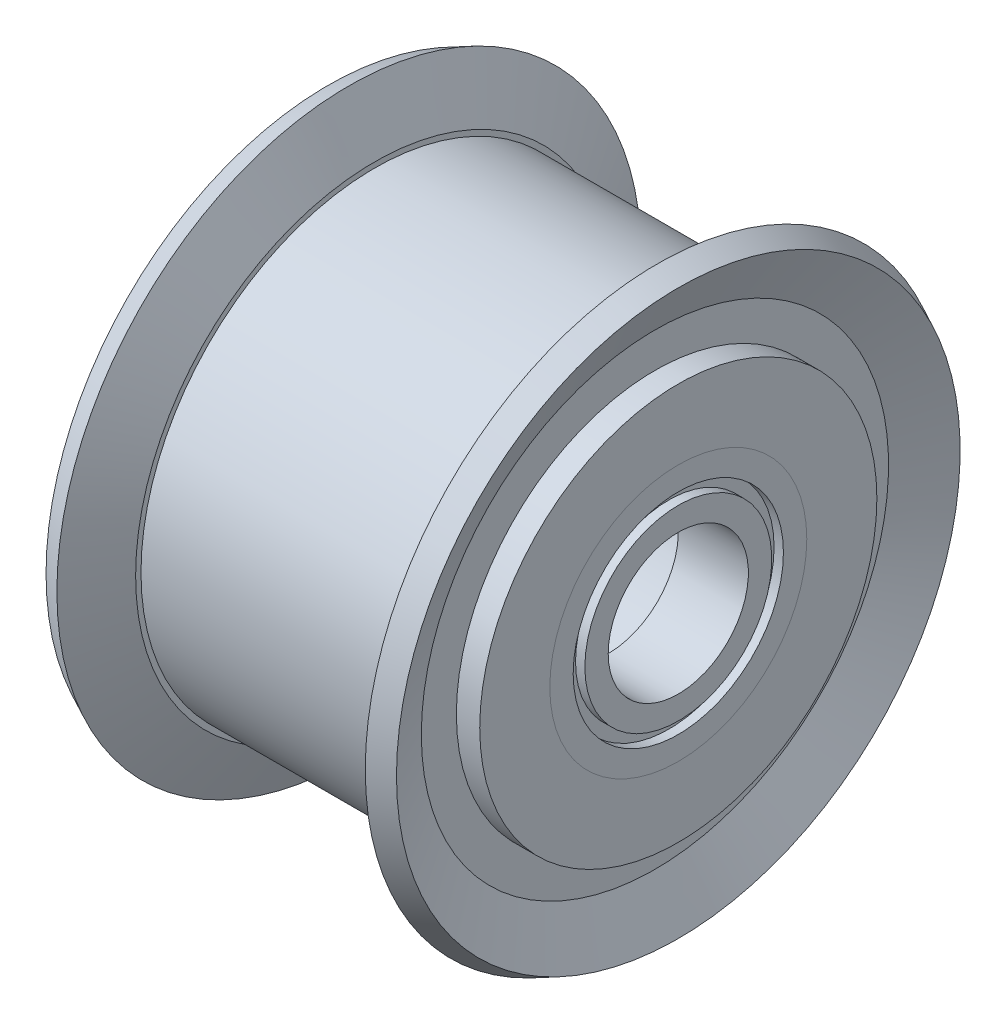
ISO-10303-21;
HEADER;
FILE_DESCRIPTION(('STEP AP214'),'2;1');
FILE_NAME('part.step','',(''),(''),'','','');
FILE_SCHEMA(('AUTOMOTIVE_DESIGN { 1 0 10303 214 1 1 1 1 }'));
ENDSEC;
DATA;
#1=APPLICATION_CONTEXT('core data for automotive mechanical design processes');
#2=APPLICATION_PROTOCOL_DEFINITION('international standard','automotive_design',2000,#1);
#3=PRODUCT_CONTEXT('',#1,'mechanical');
#4=PRODUCT('Part','Part','',(#3));
#5=PRODUCT_RELATED_PRODUCT_CATEGORY('part','',(#4));
#6=PRODUCT_DEFINITION_FORMATION('','',#4);
#7=PRODUCT_DEFINITION_CONTEXT('part definition',#1,'design');
#8=PRODUCT_DEFINITION('design','',#6,#7);
#9=PRODUCT_DEFINITION_SHAPE('','',#8);
#10=(LENGTH_UNIT() NAMED_UNIT(*) SI_UNIT(.MILLI.,.METRE.));
#11=(NAMED_UNIT(*) PLANE_ANGLE_UNIT() SI_UNIT($,.RADIAN.));
#12=(NAMED_UNIT(*) SI_UNIT($,.STERADIAN.) SOLID_ANGLE_UNIT());
#13=UNCERTAINTY_MEASURE_WITH_UNIT(LENGTH_MEASURE(1.E-05),#10,'distance_accuracy_value','');
#14=(GEOMETRIC_REPRESENTATION_CONTEXT(3) GLOBAL_UNCERTAINTY_ASSIGNED_CONTEXT((#13)) GLOBAL_UNIT_ASSIGNED_CONTEXT((#10,
#11,#12)) REPRESENTATION_CONTEXT('',''));
#15=CARTESIAN_POINT('',(0.,0.,0.));
#16=DIRECTION('',(0.,0.,1.));
#17=DIRECTION('',(1.,0.,0.));
#18=AXIS2_PLACEMENT_3D('',#15,#16,#17);
#19=CARTESIAN_POINT('',(-4.5,5.5,0.));
#20=DIRECTION('',(-1.,0.,0.));
#21=DIRECTION('',(0.,0.,1.));
#22=AXIS2_PLACEMENT_3D('',#19,#20,#21);
#23=PLANE('',#22);
#24=CARTESIAN_POINT('',(-4.5,0.,0.));
#25=DIRECTION('',(-1.,0.,0.));
#26=DIRECTION('',(0.,0.,1.));
#27=AXIS2_PLACEMENT_3D('',#24,#25,#26);
#28=CIRCLE('',#27,5.5);
#29=CARTESIAN_POINT('',(-4.5,0.,5.5));
#30=VERTEX_POINT('',#29);
#31=EDGE_CURVE('E82',#30,#30,#28,.T.);
#32=ORIENTED_EDGE('',*,*,#31,.F.);
#33=EDGE_LOOP('',(#32));
#34=FACE_BOUND('',#33,.T.);
#35=CARTESIAN_POINT('',(-4.5,0.,0.));
#36=DIRECTION('',(-1.,0.,0.));
#37=DIRECTION('',(0.,0.,1.));
#38=AXIS2_PLACEMENT_3D('',#35,#36,#37);
#39=CIRCLE('',#38,4.5);
#40=CARTESIAN_POINT('',(-4.5,0.,4.5));
#41=VERTEX_POINT('',#40);
#42=EDGE_CURVE('E11',#41,#41,#39,.T.);
#43=ORIENTED_EDGE('',*,*,#42,.T.);
#44=EDGE_LOOP('',(#43));
#45=FACE_BOUND('',#44,.T.);
#46=ADVANCED_FACE('F42',(#34,#45),#23,.F.);
#47=CARTESIAN_POINT('',(0.,0.,0.));
#48=DIRECTION('',(-1.,0.,0.));
#49=DIRECTION('',(0.,0.,1.));
#50=AXIS2_PLACEMENT_3D('',#47,#48,#49);
#51=CYLINDRICAL_SURFACE('',#50,4.5);
#52=ORIENTED_EDGE('',*,*,#42,.F.);
#53=EDGE_LOOP('',(#52));
#54=FACE_BOUND('',#53,.T.);
#55=CARTESIAN_POINT('',(-4.9,0.,0.));
#56=DIRECTION('',(-1.,0.,0.));
#57=DIRECTION('',(0.,0.,1.));
#58=AXIS2_PLACEMENT_3D('',#55,#56,#57);
#59=CIRCLE('',#58,4.5);
#60=CARTESIAN_POINT('',(-4.9,0.,4.5));
#61=VERTEX_POINT('',#60);
#62=EDGE_CURVE('E48',#61,#61,#59,.T.);
#63=ORIENTED_EDGE('',*,*,#62,.T.);
#64=EDGE_LOOP('',(#63));
#65=FACE_BOUND('',#64,.T.);
#66=ADVANCED_FACE('F89',(#54,#65),#51,.F.);
#67=CARTESIAN_POINT('',(-4.9,4.5,0.));
#68=DIRECTION('',(-1.,0.,0.));
#69=DIRECTION('',(0.,0.,1.));
#70=AXIS2_PLACEMENT_3D('',#67,#68,#69);
#71=PLANE('',#70);
#72=ORIENTED_EDGE('',*,*,#62,.F.);
#73=EDGE_LOOP('',(#72));
#74=FACE_BOUND('',#73,.T.);
#75=CARTESIAN_POINT('',(-4.9,0.,0.));
#76=DIRECTION('',(-1.,0.,0.));
#77=DIRECTION('',(0.,0.,1.));
#78=AXIS2_PLACEMENT_3D('',#75,#76,#77);
#79=CIRCLE('',#78,4.);
#80=CARTESIAN_POINT('',(-4.9,0.,4.));
#81=VERTEX_POINT('',#80);
#82=EDGE_CURVE('E52',#81,#81,#79,.T.);
#83=ORIENTED_EDGE('',*,*,#82,.T.);
#84=EDGE_LOOP('',(#83));
#85=FACE_BOUND('',#84,.T.);
#86=ADVANCED_FACE('F93',(#74,#85),#71,.F.);
#87=CARTESIAN_POINT('',(0.,0.,0.));
#88=DIRECTION('',(-1.,0.,0.));
#89=DIRECTION('',(0.,0.,1.));
#90=AXIS2_PLACEMENT_3D('',#87,#88,#89);
#91=CYLINDRICAL_SURFACE('',#90,4.);
#92=ORIENTED_EDGE('',*,*,#82,.F.);
#93=EDGE_LOOP('',(#92));
#94=FACE_BOUND('',#93,.T.);
#95=CARTESIAN_POINT('',(-4.5,0.,0.));
#96=DIRECTION('',(-1.,0.,0.));
#97=DIRECTION('',(0.,0.,1.));
#98=AXIS2_PLACEMENT_3D('',#95,#96,#97);
#99=CIRCLE('',#98,4.);
#100=CARTESIAN_POINT('',(-4.5,0.,4.));
#101=VERTEX_POINT('',#100);
#102=EDGE_CURVE('E56',#101,#101,#99,.T.);
#103=ORIENTED_EDGE('',*,*,#102,.T.);
#104=EDGE_LOOP('',(#103));
#105=FACE_BOUND('',#104,.T.);
#106=ADVANCED_FACE('F98',(#94,#105),#91,.T.);
#107=CARTESIAN_POINT('',(-4.5,4.,0.));
#108=DIRECTION('',(-1.,0.,0.));
#109=DIRECTION('',(0.,0.,1.));
#110=AXIS2_PLACEMENT_3D('',#107,#108,#109);
#111=PLANE('',#110);
#112=ORIENTED_EDGE('',*,*,#102,.F.);
#113=EDGE_LOOP('',(#112));
#114=FACE_BOUND('',#113,.T.);
#115=CARTESIAN_POINT('',(-4.5,0.,0.));
#116=DIRECTION('',(-1.,0.,0.));
#117=DIRECTION('',(0.,0.,1.));
#118=AXIS2_PLACEMENT_3D('',#115,#116,#117);
#119=CIRCLE('',#118,3.);
#120=CARTESIAN_POINT('',(-4.5,0.,3.));
#121=VERTEX_POINT('',#120);
#122=EDGE_CURVE('E61',#121,#121,#119,.T.);
#123=ORIENTED_EDGE('',*,*,#122,.T.);
#124=EDGE_LOOP('',(#123));
#125=FACE_BOUND('',#124,.T.);
#126=ADVANCED_FACE('F104',(#114,#125),#111,.F.);
#127=CARTESIAN_POINT('',(0.,0.,0.));
#128=DIRECTION('',(-1.,0.,0.));
#129=DIRECTION('',(0.,0.,1.));
#130=AXIS2_PLACEMENT_3D('',#127,#128,#129);
#131=CYLINDRICAL_SURFACE('',#130,3.);
#132=ORIENTED_EDGE('',*,*,#122,.F.);
#133=EDGE_LOOP('',(#132));
#134=FACE_BOUND('',#133,.T.);
#135=CARTESIAN_POINT('',(-7.5,0.,0.));
#136=DIRECTION('',(-1.,0.,0.));
#137=DIRECTION('',(0.,0.,1.));
#138=AXIS2_PLACEMENT_3D('',#135,#136,#137);
#139=CIRCLE('',#138,3.);
#140=CARTESIAN_POINT('',(-7.5,0.,3.));
#141=VERTEX_POINT('',#140);
#142=EDGE_CURVE('E64',#141,#141,#139,.T.);
#143=ORIENTED_EDGE('',*,*,#142,.T.);
#144=EDGE_LOOP('',(#143));
#145=FACE_BOUND('',#144,.T.);
#146=ADVANCED_FACE('F108',(#134,#145),#131,.F.);
#147=CARTESIAN_POINT('',(-7.5,4.,0.));
#148=DIRECTION('',(1.,0.,0.));
#149=DIRECTION('',(0.,0.,-1.));
#150=AXIS2_PLACEMENT_3D('',#147,#148,#149);
#151=PLANE('',#150);
#152=ORIENTED_EDGE('',*,*,#142,.F.);
#153=EDGE_LOOP('',(#152));
#154=FACE_BOUND('',#153,.T.);
#155=CARTESIAN_POINT('',(-7.5,0.,0.));
#156=DIRECTION('',(-1.,0.,0.));
#157=DIRECTION('',(0.,0.,1.));
#158=AXIS2_PLACEMENT_3D('',#155,#156,#157);
#159=CIRCLE('',#158,4.);
#160=CARTESIAN_POINT('',(-7.5,0.,4.));
#161=VERTEX_POINT('',#160);
#162=EDGE_CURVE('E67',#161,#161,#159,.T.);
#163=ORIENTED_EDGE('',*,*,#162,.T.);
#164=EDGE_LOOP('',(#163));
#165=FACE_BOUND('',#164,.T.);
#166=ADVANCED_FACE('F112',(#154,#165),#151,.F.);
#167=CARTESIAN_POINT('',(0.,0.,0.));
#168=DIRECTION('',(-1.,0.,0.));
#169=DIRECTION('',(0.,0.,1.));
#170=AXIS2_PLACEMENT_3D('',#167,#168,#169);
#171=CYLINDRICAL_SURFACE('',#170,4.);
#172=ORIENTED_EDGE('',*,*,#162,.F.);
#173=EDGE_LOOP('',(#172));
#174=FACE_BOUND('',#173,.T.);
#175=CARTESIAN_POINT('',(-7.1,0.,0.));
#176=DIRECTION('',(-1.,0.,0.));
#177=DIRECTION('',(0.,0.,1.));
#178=AXIS2_PLACEMENT_3D('',#175,#176,#177);
#179=CIRCLE('',#178,4.);
#180=CARTESIAN_POINT('',(-7.1,0.,4.));
#181=VERTEX_POINT('',#180);
#182=EDGE_CURVE('E70',#181,#181,#179,.T.);
#183=ORIENTED_EDGE('',*,*,#182,.T.);
#184=EDGE_LOOP('',(#183));
#185=FACE_BOUND('',#184,.T.);
#186=ADVANCED_FACE('F116',(#174,#185),#171,.T.);
#187=CARTESIAN_POINT('',(-7.1,4.5,0.));
#188=DIRECTION('',(1.,0.,0.));
#189=DIRECTION('',(0.,0.,-1.));
#190=AXIS2_PLACEMENT_3D('',#187,#188,#189);
#191=PLANE('',#190);
#192=ORIENTED_EDGE('',*,*,#182,.F.);
#193=EDGE_LOOP('',(#192));
#194=FACE_BOUND('',#193,.T.);
#195=CARTESIAN_POINT('',(-7.1,0.,0.));
#196=DIRECTION('',(-1.,0.,0.));
#197=DIRECTION('',(0.,0.,1.));
#198=AXIS2_PLACEMENT_3D('',#195,#196,#197);
#199=CIRCLE('',#198,4.5);
#200=CARTESIAN_POINT('',(-7.1,0.,4.5));
#201=VERTEX_POINT('',#200);
#202=EDGE_CURVE('E73',#201,#201,#199,.T.);
#203=ORIENTED_EDGE('',*,*,#202,.T.);
#204=EDGE_LOOP('',(#203));
#205=FACE_BOUND('',#204,.T.);
#206=ADVANCED_FACE('F120',(#194,#205),#191,.F.);
#207=CARTESIAN_POINT('',(0.,0.,0.));
#208=DIRECTION('',(-1.,0.,0.));
#209=DIRECTION('',(0.,0.,1.));
#210=AXIS2_PLACEMENT_3D('',#207,#208,#209);
#211=CYLINDRICAL_SURFACE('',#210,4.5);
#212=ORIENTED_EDGE('',*,*,#202,.F.);
#213=EDGE_LOOP('',(#212));
#214=FACE_BOUND('',#213,.T.);
#215=CARTESIAN_POINT('',(-7.5,0.,0.));
#216=DIRECTION('',(-1.,0.,0.));
#217=DIRECTION('',(0.,0.,1.));
#218=AXIS2_PLACEMENT_3D('',#215,#216,#217);
#219=CIRCLE('',#218,4.5);
#220=CARTESIAN_POINT('',(-7.5,0.,4.5));
#221=VERTEX_POINT('',#220);
#222=EDGE_CURVE('E76',#221,#221,#219,.T.);
#223=ORIENTED_EDGE('',*,*,#222,.T.);
#224=EDGE_LOOP('',(#223));
#225=FACE_BOUND('',#224,.T.);
#226=ADVANCED_FACE('F124',(#214,#225),#211,.F.);
#227=CARTESIAN_POINT('',(-7.5,5.5,0.));
#228=DIRECTION('',(1.,0.,0.));
#229=DIRECTION('',(0.,0.,-1.));
#230=AXIS2_PLACEMENT_3D('',#227,#228,#229);
#231=PLANE('',#230);
#232=ORIENTED_EDGE('',*,*,#222,.F.);
#233=EDGE_LOOP('',(#232));
#234=FACE_BOUND('',#233,.T.);
#235=CARTESIAN_POINT('',(-7.5,0.,0.));
#236=DIRECTION('',(-1.,0.,0.));
#237=DIRECTION('',(0.,0.,1.));
#238=AXIS2_PLACEMENT_3D('',#235,#236,#237);
#239=CIRCLE('',#238,5.5);
#240=CARTESIAN_POINT('',(-7.5,0.,5.5));
#241=VERTEX_POINT('',#240);
#242=EDGE_CURVE('E79',#241,#241,#239,.T.);
#243=ORIENTED_EDGE('',*,*,#242,.T.);
#244=EDGE_LOOP('',(#243));
#245=FACE_BOUND('',#244,.T.);
#246=ADVANCED_FACE('F128',(#234,#245),#231,.F.);
#247=CARTESIAN_POINT('',(0.,0.,0.));
#248=DIRECTION('',(-1.,0.,0.));
#249=DIRECTION('',(0.,0.,1.));
#250=AXIS2_PLACEMENT_3D('',#247,#248,#249);
#251=CYLINDRICAL_SURFACE('',#250,5.5);
#252=ORIENTED_EDGE('',*,*,#242,.F.);
#253=EDGE_LOOP('',(#252));
#254=FACE_BOUND('',#253,.T.);
#255=ORIENTED_EDGE('',*,*,#31,.T.);
#256=EDGE_LOOP('',(#255));
#257=FACE_BOUND('',#256,.T.);
#258=ADVANCED_FACE('F86',(#254,#257),#251,.T.);
#259=CLOSED_SHELL('',(#46,#66,#86,#106,#126,#146,#166,#186,#206,#226,#246,#258));
#260=MANIFOLD_SOLID_BREP('B2',#259);
#261=CARTESIAN_POINT('',(4.5,5.5,0.));
#262=DIRECTION('',(1.,0.,0.));
#263=DIRECTION('',(0.,0.,-1.));
#264=AXIS2_PLACEMENT_3D('',#261,#262,#263);
#265=PLANE('',#264);
#266=CARTESIAN_POINT('',(4.5,0.,0.));
#267=DIRECTION('',(-1.,0.,0.));
#268=DIRECTION('',(0.,0.,1.));
#269=AXIS2_PLACEMENT_3D('',#266,#267,#268);
#270=CIRCLE('',#269,4.5);
#271=CARTESIAN_POINT('',(4.5,0.,4.5));
#272=VERTEX_POINT('',#271);
#273=EDGE_CURVE('E41',#272,#272,#270,.T.);
#274=ORIENTED_EDGE('',*,*,#273,.F.);
#275=EDGE_LOOP('',(#274));
#276=FACE_BOUND('',#275,.T.);
#277=CARTESIAN_POINT('',(4.5,0.,0.));
#278=DIRECTION('',(-1.,0.,0.));
#279=DIRECTION('',(0.,0.,1.));
#280=AXIS2_PLACEMENT_3D('',#277,#278,#279);
#281=CIRCLE('',#280,5.5);
#282=CARTESIAN_POINT('',(4.5,0.,5.5));
#283=VERTEX_POINT('',#282);
#284=EDGE_CURVE('E272',#283,#283,#281,.T.);
#285=ORIENTED_EDGE('',*,*,#284,.T.);
#286=EDGE_LOOP('',(#285));
#287=FACE_BOUND('',#286,.T.);
#288=ADVANCED_FACE('F232',(#276,#287),#265,.F.);
#289=CARTESIAN_POINT('',(0.,0.,0.));
#290=DIRECTION('',(-1.,0.,0.));
#291=DIRECTION('',(0.,0.,1.));
#292=AXIS2_PLACEMENT_3D('',#289,#290,#291);
#293=CYLINDRICAL_SURFACE('',#292,4.5);
#294=CARTESIAN_POINT('',(4.9,0.,0.));
#295=DIRECTION('',(-1.,0.,0.));
#296=DIRECTION('',(0.,0.,1.));
#297=AXIS2_PLACEMENT_3D('',#294,#295,#296);
#298=CIRCLE('',#297,4.5);
#299=CARTESIAN_POINT('',(4.9,0.,4.5));
#300=VERTEX_POINT('',#299);
#301=EDGE_CURVE('E238',#300,#300,#298,.T.);
#302=ORIENTED_EDGE('',*,*,#301,.F.);
#303=EDGE_LOOP('',(#302));
#304=FACE_BOUND('',#303,.T.);
#305=ORIENTED_EDGE('',*,*,#273,.T.);
#306=EDGE_LOOP('',(#305));
#307=FACE_BOUND('',#306,.T.);
#308=ADVANCED_FACE('F333',(#304,#307),#293,.F.);
#309=CARTESIAN_POINT('',(4.9,4.5,0.));
#310=DIRECTION('',(1.,0.,0.));
#311=DIRECTION('',(0.,0.,-1.));
#312=AXIS2_PLACEMENT_3D('',#309,#310,#311);
#313=PLANE('',#312);
#314=CARTESIAN_POINT('',(4.9,0.,0.));
#315=DIRECTION('',(-1.,0.,0.));
#316=DIRECTION('',(0.,0.,1.));
#317=AXIS2_PLACEMENT_3D('',#314,#315,#316);
#318=CIRCLE('',#317,4.);
#319=CARTESIAN_POINT('',(4.9,0.,4.));
#320=VERTEX_POINT('',#319);
#321=EDGE_CURVE('E242',#320,#320,#318,.T.);
#322=ORIENTED_EDGE('',*,*,#321,.F.);
#323=EDGE_LOOP('',(#322));
#324=FACE_BOUND('',#323,.T.);
#325=ORIENTED_EDGE('',*,*,#301,.T.);
#326=EDGE_LOOP('',(#325));
#327=FACE_BOUND('',#326,.T.);
#328=ADVANCED_FACE('F328',(#324,#327),#313,.F.);
#329=CARTESIAN_POINT('',(0.,0.,0.));
#330=DIRECTION('',(-1.,0.,0.));
#331=DIRECTION('',(0.,0.,1.));
#332=AXIS2_PLACEMENT_3D('',#329,#330,#331);
#333=CYLINDRICAL_SURFACE('',#332,4.);
#334=CARTESIAN_POINT('',(4.5,0.,0.));
#335=DIRECTION('',(-1.,0.,0.));
#336=DIRECTION('',(0.,0.,1.));
#337=AXIS2_PLACEMENT_3D('',#334,#335,#336);
#338=CIRCLE('',#337,4.);
#339=CARTESIAN_POINT('',(4.5,0.,4.));
#340=VERTEX_POINT('',#339);
#341=EDGE_CURVE('E246',#340,#340,#338,.T.);
#342=ORIENTED_EDGE('',*,*,#341,.F.);
#343=EDGE_LOOP('',(#342));
#344=FACE_BOUND('',#343,.T.);
#345=ORIENTED_EDGE('',*,*,#321,.T.);
#346=EDGE_LOOP('',(#345));
#347=FACE_BOUND('',#346,.T.);
#348=ADVANCED_FACE('F322',(#344,#347),#333,.T.);
#349=CARTESIAN_POINT('',(4.5,4.,0.));
#350=DIRECTION('',(1.,0.,0.));
#351=DIRECTION('',(0.,0.,-1.));
#352=AXIS2_PLACEMENT_3D('',#349,#350,#351);
#353=PLANE('',#352);
#354=CARTESIAN_POINT('',(4.5,0.,0.));
#355=DIRECTION('',(-1.,0.,0.));
#356=DIRECTION('',(0.,0.,1.));
#357=AXIS2_PLACEMENT_3D('',#354,#355,#356);
#358=CIRCLE('',#357,3.);
#359=CARTESIAN_POINT('',(4.5,0.,3.));
#360=VERTEX_POINT('',#359);
#361=EDGE_CURVE('E251',#360,#360,#358,.T.);
#362=ORIENTED_EDGE('',*,*,#361,.F.);
#363=EDGE_LOOP('',(#362));
#364=FACE_BOUND('',#363,.T.);
#365=ORIENTED_EDGE('',*,*,#341,.T.);
#366=EDGE_LOOP('',(#365));
#367=FACE_BOUND('',#366,.T.);
#368=ADVANCED_FACE('F316',(#364,#367),#353,.F.);
#369=CARTESIAN_POINT('',(0.,0.,0.));
#370=DIRECTION('',(-1.,0.,0.));
#371=DIRECTION('',(0.,0.,1.));
#372=AXIS2_PLACEMENT_3D('',#369,#370,#371);
#373=CYLINDRICAL_SURFACE('',#372,3.);
#374=CARTESIAN_POINT('',(7.5,0.,0.));
#375=DIRECTION('',(-1.,0.,0.));
#376=DIRECTION('',(0.,0.,1.));
#377=AXIS2_PLACEMENT_3D('',#374,#375,#376);
#378=CIRCLE('',#377,3.);
#379=CARTESIAN_POINT('',(7.5,0.,3.));
#380=VERTEX_POINT('',#379);
#381=EDGE_CURVE('E254',#380,#380,#378,.T.);
#382=ORIENTED_EDGE('',*,*,#381,.F.);
#383=EDGE_LOOP('',(#382));
#384=FACE_BOUND('',#383,.T.);
#385=ORIENTED_EDGE('',*,*,#361,.T.);
#386=EDGE_LOOP('',(#385));
#387=FACE_BOUND('',#386,.T.);
#388=ADVANCED_FACE('F310',(#384,#387),#373,.F.);
#389=CARTESIAN_POINT('',(7.5,4.,0.));
#390=DIRECTION('',(-1.,0.,0.));
#391=DIRECTION('',(0.,0.,1.));
#392=AXIS2_PLACEMENT_3D('',#389,#390,#391);
#393=PLANE('',#392);
#394=CARTESIAN_POINT('',(7.5,0.,0.));
#395=DIRECTION('',(-1.,0.,0.));
#396=DIRECTION('',(0.,0.,1.));
#397=AXIS2_PLACEMENT_3D('',#394,#395,#396);
#398=CIRCLE('',#397,4.);
#399=CARTESIAN_POINT('',(7.5,0.,4.));
#400=VERTEX_POINT('',#399);
#401=EDGE_CURVE('E257',#400,#400,#398,.T.);
#402=ORIENTED_EDGE('',*,*,#401,.F.);
#403=EDGE_LOOP('',(#402));
#404=FACE_BOUND('',#403,.T.);
#405=ORIENTED_EDGE('',*,*,#381,.T.);
#406=EDGE_LOOP('',(#405));
#407=FACE_BOUND('',#406,.T.);
#408=ADVANCED_FACE('F304',(#404,#407),#393,.F.);
#409=CARTESIAN_POINT('',(0.,0.,0.));
#410=DIRECTION('',(-1.,0.,0.));
#411=DIRECTION('',(0.,0.,1.));
#412=AXIS2_PLACEMENT_3D('',#409,#410,#411);
#413=CYLINDRICAL_SURFACE('',#412,4.);
#414=CARTESIAN_POINT('',(7.1,0.,0.));
#415=DIRECTION('',(-1.,0.,0.));
#416=DIRECTION('',(0.,0.,1.));
#417=AXIS2_PLACEMENT_3D('',#414,#415,#416);
#418=CIRCLE('',#417,4.);
#419=CARTESIAN_POINT('',(7.1,0.,4.));
#420=VERTEX_POINT('',#419);
#421=EDGE_CURVE('E260',#420,#420,#418,.T.);
#422=ORIENTED_EDGE('',*,*,#421,.F.);
#423=EDGE_LOOP('',(#422));
#424=FACE_BOUND('',#423,.T.);
#425=ORIENTED_EDGE('',*,*,#401,.T.);
#426=EDGE_LOOP('',(#425));
#427=FACE_BOUND('',#426,.T.);
#428=ADVANCED_FACE('F298',(#424,#427),#413,.T.);
#429=CARTESIAN_POINT('',(7.1,4.5,0.));
#430=DIRECTION('',(-1.,0.,0.));
#431=DIRECTION('',(0.,0.,1.));
#432=AXIS2_PLACEMENT_3D('',#429,#430,#431);
#433=PLANE('',#432);
#434=CARTESIAN_POINT('',(7.1,0.,0.));
#435=DIRECTION('',(-1.,0.,0.));
#436=DIRECTION('',(0.,0.,1.));
#437=AXIS2_PLACEMENT_3D('',#434,#435,#436);
#438=CIRCLE('',#437,4.5);
#439=CARTESIAN_POINT('',(7.1,0.,4.5));
#440=VERTEX_POINT('',#439);
#441=EDGE_CURVE('E263',#440,#440,#438,.T.);
#442=ORIENTED_EDGE('',*,*,#441,.F.);
#443=EDGE_LOOP('',(#442));
#444=FACE_BOUND('',#443,.T.);
#445=ORIENTED_EDGE('',*,*,#421,.T.);
#446=EDGE_LOOP('',(#445));
#447=FACE_BOUND('',#446,.T.);
#448=ADVANCED_FACE('F292',(#444,#447),#433,.F.);
#449=CARTESIAN_POINT('',(0.,0.,0.));
#450=DIRECTION('',(-1.,0.,0.));
#451=DIRECTION('',(0.,0.,1.));
#452=AXIS2_PLACEMENT_3D('',#449,#450,#451);
#453=CYLINDRICAL_SURFACE('',#452,4.5);
#454=CARTESIAN_POINT('',(7.5,0.,0.));
#455=DIRECTION('',(-1.,0.,0.));
#456=DIRECTION('',(0.,0.,1.));
#457=AXIS2_PLACEMENT_3D('',#454,#455,#456);
#458=CIRCLE('',#457,4.5);
#459=CARTESIAN_POINT('',(7.5,0.,4.5));
#460=VERTEX_POINT('',#459);
#461=EDGE_CURVE('E266',#460,#460,#458,.T.);
#462=ORIENTED_EDGE('',*,*,#461,.F.);
#463=EDGE_LOOP('',(#462));
#464=FACE_BOUND('',#463,.T.);
#465=ORIENTED_EDGE('',*,*,#441,.T.);
#466=EDGE_LOOP('',(#465));
#467=FACE_BOUND('',#466,.T.);
#468=ADVANCED_FACE('F286',(#464,#467),#453,.F.);
#469=CARTESIAN_POINT('',(7.5,5.5,0.));
#470=DIRECTION('',(-1.,0.,0.));
#471=DIRECTION('',(0.,0.,1.));
#472=AXIS2_PLACEMENT_3D('',#469,#470,#471);
#473=PLANE('',#472);
#474=CARTESIAN_POINT('',(7.5,0.,0.));
#475=DIRECTION('',(-1.,0.,0.));
#476=DIRECTION('',(0.,0.,1.));
#477=AXIS2_PLACEMENT_3D('',#474,#475,#476);
#478=CIRCLE('',#477,5.5);
#479=CARTESIAN_POINT('',(7.5,0.,5.5));
#480=VERTEX_POINT('',#479);
#481=EDGE_CURVE('E269',#480,#480,#478,.T.);
#482=ORIENTED_EDGE('',*,*,#481,.F.);
#483=EDGE_LOOP('',(#482));
#484=FACE_BOUND('',#483,.T.);
#485=ORIENTED_EDGE('',*,*,#461,.T.);
#486=EDGE_LOOP('',(#485));
#487=FACE_BOUND('',#486,.T.);
#488=ADVANCED_FACE('F280',(#484,#487),#473,.F.);
#489=CARTESIAN_POINT('',(0.,0.,0.));
#490=DIRECTION('',(-1.,0.,0.));
#491=DIRECTION('',(0.,0.,1.));
#492=AXIS2_PLACEMENT_3D('',#489,#490,#491);
#493=CYLINDRICAL_SURFACE('',#492,5.5);
#494=ORIENTED_EDGE('',*,*,#284,.F.);
#495=EDGE_LOOP('',(#494));
#496=FACE_BOUND('',#495,.T.);
#497=ORIENTED_EDGE('',*,*,#481,.T.);
#498=EDGE_LOOP('',(#497));
#499=FACE_BOUND('',#498,.T.);
#500=ADVANCED_FACE('F277',(#496,#499),#493,.T.);
#501=CLOSED_SHELL('',(#288,#308,#328,#348,#368,#388,#408,#428,#448,#468,#488,#500));
#502=MANIFOLD_SOLID_BREP('B6',#501);
#503=CARTESIAN_POINT('',(0.,0.,0.));
#504=DIRECTION('',(-1.,0.,0.));
#505=DIRECTION('',(0.,0.,1.));
#506=AXIS2_PLACEMENT_3D('',#503,#504,#505);
#507=CYLINDRICAL_SURFACE('',#506,8.5);
#508=CARTESIAN_POINT('',(-5.5,0.,0.));
#509=DIRECTION('',(-1.,0.,0.));
#510=DIRECTION('',(0.,0.,1.));
#511=AXIS2_PLACEMENT_3D('',#508,#509,#510);
#512=CIRCLE('',#511,8.5);
#513=CARTESIAN_POINT('',(-5.5,0.,8.5));
#514=VERTEX_POINT('',#513);
#515=EDGE_CURVE('E444',#514,#514,#512,.T.);
#516=ORIENTED_EDGE('',*,*,#515,.F.);
#517=EDGE_LOOP('',(#516));
#518=FACE_BOUND('',#517,.T.);
#519=CARTESIAN_POINT('',(-6.5,0.,0.));
#520=DIRECTION('',(-1.,0.,0.));
#521=DIRECTION('',(0.,0.,1.));
#522=AXIS2_PLACEMENT_3D('',#519,#520,#521);
#523=CIRCLE('',#522,8.5);
#524=CARTESIAN_POINT('',(-6.5,0.,8.5));
#525=VERTEX_POINT('',#524);
#526=EDGE_CURVE('E231',#525,#525,#523,.T.);
#527=ORIENTED_EDGE('',*,*,#526,.T.);
#528=EDGE_LOOP('',(#527));
#529=FACE_BOUND('',#528,.T.);
#530=ADVANCED_FACE('F422',(#518,#529),#507,.F.);
#531=CARTESIAN_POINT('',(-6.5,8.5,0.));
#532=DIRECTION('',(1.,0.,0.));
#533=DIRECTION('',(0.,0.,-1.));
#534=AXIS2_PLACEMENT_3D('',#531,#532,#533);
#535=PLANE('',#534);
#536=ORIENTED_EDGE('',*,*,#526,.F.);
#537=EDGE_LOOP('',(#536));
#538=FACE_BOUND('',#537,.T.);
#539=CARTESIAN_POINT('',(-6.5,0.,0.));
#540=DIRECTION('',(-1.,0.,0.));
#541=DIRECTION('',(0.,0.,1.));
#542=AXIS2_PLACEMENT_3D('',#539,#540,#541);
#543=CIRCLE('',#542,10.);
#544=CARTESIAN_POINT('',(-6.5,0.,10.));
#545=VERTEX_POINT('',#544);
#546=EDGE_CURVE('E428',#545,#545,#543,.T.);
#547=ORIENTED_EDGE('',*,*,#546,.T.);
#548=EDGE_LOOP('',(#547));
#549=FACE_BOUND('',#548,.T.);
#550=ADVANCED_FACE('F451',(#538,#549),#535,.F.);
#551=CARTESIAN_POINT('',(-7.5,0.,0.));
#552=DIRECTION('',(-1.,0.,0.));
#553=DIRECTION('',(0.,0.,1.));
#554=AXIS2_PLACEMENT_3D('',#551,#552,#553);
#555=CONICAL_SURFACE('',#554,12.0639798031921,1.11962472941753);
#556=ORIENTED_EDGE('',*,*,#546,.F.);
#557=EDGE_LOOP('',(#556));
#558=FACE_BOUND('',#557,.T.);
#559=CARTESIAN_POINT('',(-7.5,0.,0.));
#560=DIRECTION('',(-1.,0.,0.));
#561=DIRECTION('',(0.,0.,1.));
#562=AXIS2_PLACEMENT_3D('',#559,#560,#561);
#563=CIRCLE('',#562,12.0639798031921);
#564=CARTESIAN_POINT('',(-7.5,0.,12.0639798031921));
#565=VERTEX_POINT('',#564);
#566=EDGE_CURVE('E432',#565,#565,#563,.T.);
#567=ORIENTED_EDGE('',*,*,#566,.T.);
#568=EDGE_LOOP('',(#567));
#569=FACE_BOUND('',#568,.T.);
#570=ADVANCED_FACE('F455',(#558,#569),#555,.F.);
#571=CARTESIAN_POINT('',(-6.60006312000472,0.,0.));
#572=DIRECTION('',(1.,0.,0.));
#573=DIRECTION('',(0.,0.,-1.));
#574=AXIS2_PLACEMENT_3D('',#571,#572,#573);
#575=CONICAL_SURFACE('',#574,12.5,0.451171597377368);
#576=ORIENTED_EDGE('',*,*,#566,.F.);
#577=EDGE_LOOP('',(#576));
#578=FACE_BOUND('',#577,.T.);
#579=CARTESIAN_POINT('',(-6.60006312000472,0.,0.));
#580=DIRECTION('',(-1.,0.,0.));
#581=DIRECTION('',(0.,0.,1.));
#582=AXIS2_PLACEMENT_3D('',#579,#580,#581);
#583=CIRCLE('',#582,12.5);
#584=CARTESIAN_POINT('',(-6.60006312000472,0.,12.5));
#585=VERTEX_POINT('',#584);
#586=EDGE_CURVE('E436',#585,#585,#583,.T.);
#587=ORIENTED_EDGE('',*,*,#586,.T.);
#588=EDGE_LOOP('',(#587));
#589=FACE_BOUND('',#588,.T.);
#590=ADVANCED_FACE('F460',(#578,#589),#575,.T.);
#591=CARTESIAN_POINT('',(-5.5,0.,0.));
#592=DIRECTION('',(-1.,0.,0.));
#593=DIRECTION('',(0.,0.,1.));
#594=AXIS2_PLACEMENT_3D('',#591,#592,#593);
#595=CONICAL_SURFACE('',#594,10.2294919380737,1.11962472941753);
#596=ORIENTED_EDGE('',*,*,#586,.F.);
#597=EDGE_LOOP('',(#596));
#598=FACE_BOUND('',#597,.T.);
#599=CARTESIAN_POINT('',(-5.5,0.,0.));
#600=DIRECTION('',(-1.,0.,0.));
#601=DIRECTION('',(0.,0.,1.));
#602=AXIS2_PLACEMENT_3D('',#599,#600,#601);
#603=CIRCLE('',#602,10.2294919380737);
#604=CARTESIAN_POINT('',(-5.5,0.,10.2294919380737));
#605=VERTEX_POINT('',#604);
#606=EDGE_CURVE('E441',#605,#605,#603,.T.);
#607=ORIENTED_EDGE('',*,*,#606,.T.);
#608=EDGE_LOOP('',(#607));
#609=FACE_BOUND('',#608,.T.);
#610=ADVANCED_FACE('F466',(#598,#609),#595,.T.);
#611=CARTESIAN_POINT('',(-5.5,10.2294919380737,0.));
#612=DIRECTION('',(-1.,0.,0.));
#613=DIRECTION('',(0.,0.,1.));
#614=AXIS2_PLACEMENT_3D('',#611,#612,#613);
#615=PLANE('',#614);
#616=ORIENTED_EDGE('',*,*,#606,.F.);
#617=EDGE_LOOP('',(#616));
#618=FACE_BOUND('',#617,.T.);
#619=ORIENTED_EDGE('',*,*,#515,.T.);
#620=EDGE_LOOP('',(#619));
#621=FACE_BOUND('',#620,.T.);
#622=ADVANCED_FACE('F448',(#618,#621),#615,.F.);
#623=CLOSED_SHELL('',(#530,#550,#570,#590,#610,#622));
#624=MANIFOLD_SOLID_BREP('B36',#623);
#625=CARTESIAN_POINT('',(6.60006312000472,0.,0.));
#626=DIRECTION('',(1.,0.,0.));
#627=DIRECTION('',(0.,0.,-1.));
#628=AXIS2_PLACEMENT_3D('',#625,#626,#627);
#629=CONICAL_SURFACE('',#628,12.5,1.11962472941753);
#630=CARTESIAN_POINT('',(5.5,0.,0.));
#631=DIRECTION('',(-1.,0.,0.));
#632=DIRECTION('',(0.,0.,1.));
#633=AXIS2_PLACEMENT_3D('',#630,#631,#632);
#634=CIRCLE('',#633,10.2294919380737);
#635=CARTESIAN_POINT('',(5.5,0.,10.2294919380737));
#636=VERTEX_POINT('',#635);
#637=EDGE_CURVE('E543',#636,#636,#634,.T.);
#638=ORIENTED_EDGE('',*,*,#637,.F.);
#639=EDGE_LOOP('',(#638));
#640=FACE_BOUND('',#639,.T.);
#641=CARTESIAN_POINT('',(6.60006312000472,0.,0.));
#642=DIRECTION('',(-1.,0.,0.));
#643=DIRECTION('',(0.,0.,1.));
#644=AXIS2_PLACEMENT_3D('',#641,#642,#643);
#645=CIRCLE('',#644,12.5);
#646=CARTESIAN_POINT('',(6.60006312000472,0.,12.5));
#647=VERTEX_POINT('',#646);
#648=EDGE_CURVE('E421',#647,#647,#645,.T.);
#649=ORIENTED_EDGE('',*,*,#648,.T.);
#650=EDGE_LOOP('',(#649));
#651=FACE_BOUND('',#650,.T.);
#652=ADVANCED_FACE('F521',(#640,#651),#629,.T.);
#653=CARTESIAN_POINT('',(7.5,0.,0.));
#654=DIRECTION('',(-1.,0.,0.));
#655=DIRECTION('',(0.,0.,1.));
#656=AXIS2_PLACEMENT_3D('',#653,#654,#655);
#657=CONICAL_SURFACE('',#656,12.0639798031921,0.451171597377368);
#658=ORIENTED_EDGE('',*,*,#648,.F.);
#659=EDGE_LOOP('',(#658));
#660=FACE_BOUND('',#659,.T.);
#661=CARTESIAN_POINT('',(7.5,0.,0.));
#662=DIRECTION('',(-1.,0.,0.));
#663=DIRECTION('',(0.,0.,1.));
#664=AXIS2_PLACEMENT_3D('',#661,#662,#663);
#665=CIRCLE('',#664,12.0639798031921);
#666=CARTESIAN_POINT('',(7.5,0.,12.0639798031921));
#667=VERTEX_POINT('',#666);
#668=EDGE_CURVE('E527',#667,#667,#665,.T.);
#669=ORIENTED_EDGE('',*,*,#668,.T.);
#670=EDGE_LOOP('',(#669));
#671=FACE_BOUND('',#670,.T.);
#672=ADVANCED_FACE('F550',(#660,#671),#657,.T.);
#673=CARTESIAN_POINT('',(6.5,0.,0.));
#674=DIRECTION('',(1.,0.,0.));
#675=DIRECTION('',(0.,0.,-1.));
#676=AXIS2_PLACEMENT_3D('',#673,#674,#675);
#677=CONICAL_SURFACE('',#676,10.,1.11962472941753);
#678=ORIENTED_EDGE('',*,*,#668,.F.);
#679=EDGE_LOOP('',(#678));
#680=FACE_BOUND('',#679,.T.);
#681=CARTESIAN_POINT('',(6.5,0.,0.));
#682=DIRECTION('',(-1.,0.,0.));
#683=DIRECTION('',(0.,0.,1.));
#684=AXIS2_PLACEMENT_3D('',#681,#682,#683);
#685=CIRCLE('',#684,10.);
#686=CARTESIAN_POINT('',(6.5,0.,10.));
#687=VERTEX_POINT('',#686);
#688=EDGE_CURVE('E531',#687,#687,#685,.T.);
#689=ORIENTED_EDGE('',*,*,#688,.T.);
#690=EDGE_LOOP('',(#689));
#691=FACE_BOUND('',#690,.T.);
#692=ADVANCED_FACE('F554',(#680,#691),#677,.F.);
#693=CARTESIAN_POINT('',(6.5,8.5,0.));
#694=DIRECTION('',(-1.,0.,0.));
#695=DIRECTION('',(0.,0.,1.));
#696=AXIS2_PLACEMENT_3D('',#693,#694,#695);
#697=PLANE('',#696);
#698=ORIENTED_EDGE('',*,*,#688,.F.);
#699=EDGE_LOOP('',(#698));
#700=FACE_BOUND('',#699,.T.);
#701=CARTESIAN_POINT('',(6.5,0.,0.));
#702=DIRECTION('',(-1.,0.,0.));
#703=DIRECTION('',(0.,0.,1.));
#704=AXIS2_PLACEMENT_3D('',#701,#702,#703);
#705=CIRCLE('',#704,8.5);
#706=CARTESIAN_POINT('',(6.5,0.,8.5));
#707=VERTEX_POINT('',#706);
#708=EDGE_CURVE('E535',#707,#707,#705,.T.);
#709=ORIENTED_EDGE('',*,*,#708,.T.);
#710=EDGE_LOOP('',(#709));
#711=FACE_BOUND('',#710,.T.);
#712=ADVANCED_FACE('F559',(#700,#711),#697,.F.);
#713=CARTESIAN_POINT('',(0.,0.,0.));
#714=DIRECTION('',(-1.,0.,0.));
#715=DIRECTION('',(0.,0.,1.));
#716=AXIS2_PLACEMENT_3D('',#713,#714,#715);
#717=CYLINDRICAL_SURFACE('',#716,8.5);
#718=ORIENTED_EDGE('',*,*,#708,.F.);
#719=EDGE_LOOP('',(#718));
#720=FACE_BOUND('',#719,.T.);
#721=CARTESIAN_POINT('',(5.5,0.,0.));
#722=DIRECTION('',(-1.,0.,0.));
#723=DIRECTION('',(0.,0.,1.));
#724=AXIS2_PLACEMENT_3D('',#721,#722,#723);
#725=CIRCLE('',#724,8.5);
#726=CARTESIAN_POINT('',(5.5,0.,8.5));
#727=VERTEX_POINT('',#726);
#728=EDGE_CURVE('E540',#727,#727,#725,.T.);
#729=ORIENTED_EDGE('',*,*,#728,.T.);
#730=EDGE_LOOP('',(#729));
#731=FACE_BOUND('',#730,.T.);
#732=ADVANCED_FACE('F565',(#720,#731),#717,.F.);
#733=CARTESIAN_POINT('',(5.5,10.2294919380737,0.));
#734=DIRECTION('',(1.,0.,0.));
#735=DIRECTION('',(0.,0.,-1.));
#736=AXIS2_PLACEMENT_3D('',#733,#734,#735);
#737=PLANE('',#736);
#738=ORIENTED_EDGE('',*,*,#728,.F.);
#739=EDGE_LOOP('',(#738));
#740=FACE_BOUND('',#739,.T.);
#741=ORIENTED_EDGE('',*,*,#637,.T.);
#742=EDGE_LOOP('',(#741));
#743=FACE_BOUND('',#742,.T.);
#744=ADVANCED_FACE('F547',(#740,#743),#737,.F.);
#745=CLOSED_SHELL('',(#652,#672,#692,#712,#732,#744));
#746=MANIFOLD_SOLID_BREP('B226',#745);
#747=CARTESIAN_POINT('',(-5.5,8.5,0.));
#748=DIRECTION('',(1.,0.,0.));
#749=DIRECTION('',(0.,0.,-1.));
#750=AXIS2_PLACEMENT_3D('',#747,#748,#749);
#751=PLANE('',#750);
#752=CARTESIAN_POINT('',(-5.5,0.,0.));
#753=DIRECTION('',(-1.,0.,0.));
#754=DIRECTION('',(0.,0.,1.));
#755=AXIS2_PLACEMENT_3D('',#752,#753,#754);
#756=CIRCLE('',#755,8.5);
#757=CARTESIAN_POINT('',(-5.5,0.,8.5));
#758=VERTEX_POINT('',#757);
#759=EDGE_CURVE('E653',#758,#758,#756,.T.);
#760=ORIENTED_EDGE('',*,*,#759,.F.);
#761=EDGE_LOOP('',(#760));
#762=FACE_BOUND('',#761,.T.);
#763=CARTESIAN_POINT('',(-5.5,0.,0.));
#764=DIRECTION('',(-1.,0.,0.));
#765=DIRECTION('',(0.,0.,1.));
#766=AXIS2_PLACEMENT_3D('',#763,#764,#765);
#767=CIRCLE('',#766,10.);
#768=CARTESIAN_POINT('',(-5.5,0.,10.));
#769=VERTEX_POINT('',#768);
#770=EDGE_CURVE('E520',#769,#769,#767,.T.);
#771=ORIENTED_EDGE('',*,*,#770,.T.);
#772=EDGE_LOOP('',(#771));
#773=FACE_BOUND('',#772,.T.);
#774=ADVANCED_FACE('F613',(#762,#773),#751,.F.);
#775=CARTESIAN_POINT('',(0.,0.,0.));
#776=DIRECTION('',(-1.,0.,0.));
#777=DIRECTION('',(0.,0.,1.));
#778=AXIS2_PLACEMENT_3D('',#775,#776,#777);
#779=CYLINDRICAL_SURFACE('',#778,10.);
#780=ORIENTED_EDGE('',*,*,#770,.F.);
#781=EDGE_LOOP('',(#780));
#782=FACE_BOUND('',#781,.T.);
#783=CARTESIAN_POINT('',(5.5,0.,0.));
#784=DIRECTION('',(-1.,0.,0.));
#785=DIRECTION('',(0.,0.,1.));
#786=AXIS2_PLACEMENT_3D('',#783,#784,#785);
#787=CIRCLE('',#786,10.);
#788=CARTESIAN_POINT('',(5.5,0.,10.));
#789=VERTEX_POINT('',#788);
#790=EDGE_CURVE('E619',#789,#789,#787,.T.);
#791=ORIENTED_EDGE('',*,*,#790,.T.);
#792=EDGE_LOOP('',(#791));
#793=FACE_BOUND('',#792,.T.);
#794=ADVANCED_FACE('F660',(#782,#793),#779,.T.);
#795=CARTESIAN_POINT('',(5.5,10.,0.));
#796=DIRECTION('',(-1.,0.,0.));
#797=DIRECTION('',(0.,0.,1.));
#798=AXIS2_PLACEMENT_3D('',#795,#796,#797);
#799=PLANE('',#798);
#800=ORIENTED_EDGE('',*,*,#790,.F.);
#801=EDGE_LOOP('',(#800));
#802=FACE_BOUND('',#801,.T.);
#803=CARTESIAN_POINT('',(5.5,0.,0.));
#804=DIRECTION('',(-1.,0.,0.));
#805=DIRECTION('',(0.,0.,1.));
#806=AXIS2_PLACEMENT_3D('',#803,#804,#805);
#807=CIRCLE('',#806,8.5);
#808=CARTESIAN_POINT('',(5.5,0.,8.5));
#809=VERTEX_POINT('',#808);
#810=EDGE_CURVE('E623',#809,#809,#807,.T.);
#811=ORIENTED_EDGE('',*,*,#810,.T.);
#812=EDGE_LOOP('',(#811));
#813=FACE_BOUND('',#812,.T.);
#814=ADVANCED_FACE('F664',(#802,#813),#799,.F.);
#815=CARTESIAN_POINT('',(0.,0.,0.));
#816=DIRECTION('',(-1.,0.,0.));
#817=DIRECTION('',(0.,0.,1.));
#818=AXIS2_PLACEMENT_3D('',#815,#816,#817);
#819=CYLINDRICAL_SURFACE('',#818,8.5);
#820=ORIENTED_EDGE('',*,*,#810,.F.);
#821=EDGE_LOOP('',(#820));
#822=FACE_BOUND('',#821,.T.);
#823=CARTESIAN_POINT('',(7.5,0.,0.));
#824=DIRECTION('',(-1.,0.,0.));
#825=DIRECTION('',(0.,0.,1.));
#826=AXIS2_PLACEMENT_3D('',#823,#824,#825);
#827=CIRCLE('',#826,8.5);
#828=CARTESIAN_POINT('',(7.5,0.,8.5));
#829=VERTEX_POINT('',#828);
#830=EDGE_CURVE('E627',#829,#829,#827,.T.);
#831=ORIENTED_EDGE('',*,*,#830,.T.);
#832=EDGE_LOOP('',(#831));
#833=FACE_BOUND('',#832,.T.);
#834=ADVANCED_FACE('F669',(#822,#833),#819,.T.);
#835=CARTESIAN_POINT('',(7.5,8.5,0.));
#836=DIRECTION('',(-1.,0.,0.));
#837=DIRECTION('',(0.,0.,1.));
#838=AXIS2_PLACEMENT_3D('',#835,#836,#837);
#839=PLANE('',#838);
#840=ORIENTED_EDGE('',*,*,#830,.F.);
#841=EDGE_LOOP('',(#840));
#842=FACE_BOUND('',#841,.T.);
#843=CARTESIAN_POINT('',(7.5,0.,0.));
#844=DIRECTION('',(-1.,0.,0.));
#845=DIRECTION('',(0.,0.,1.));
#846=AXIS2_PLACEMENT_3D('',#843,#844,#845);
#847=CIRCLE('',#846,5.5);
#848=CARTESIAN_POINT('',(7.5,0.,5.5));
#849=VERTEX_POINT('',#848);
#850=EDGE_CURVE('E632',#849,#849,#847,.T.);
#851=ORIENTED_EDGE('',*,*,#850,.T.);
#852=EDGE_LOOP('',(#851));
#853=FACE_BOUND('',#852,.T.);
#854=ADVANCED_FACE('F675',(#842,#853),#839,.F.);
#855=CARTESIAN_POINT('',(0.,0.,0.));
#856=DIRECTION('',(-1.,0.,0.));
#857=DIRECTION('',(0.,0.,1.));
#858=AXIS2_PLACEMENT_3D('',#855,#856,#857);
#859=CYLINDRICAL_SURFACE('',#858,5.5);
#860=ORIENTED_EDGE('',*,*,#850,.F.);
#861=EDGE_LOOP('',(#860));
#862=FACE_BOUND('',#861,.T.);
#863=CARTESIAN_POINT('',(4.5,0.,0.));
#864=DIRECTION('',(-1.,0.,0.));
#865=DIRECTION('',(0.,0.,1.));
#866=AXIS2_PLACEMENT_3D('',#863,#864,#865);
#867=CIRCLE('',#866,5.5);
#868=CARTESIAN_POINT('',(4.5,0.,5.5));
#869=VERTEX_POINT('',#868);
#870=EDGE_CURVE('E635',#869,#869,#867,.T.);
#871=ORIENTED_EDGE('',*,*,#870,.T.);
#872=EDGE_LOOP('',(#871));
#873=FACE_BOUND('',#872,.T.);
#874=ADVANCED_FACE('F679',(#862,#873),#859,.F.);
#875=CARTESIAN_POINT('',(4.5,5.5,0.));
#876=DIRECTION('',(-1.,0.,0.));
#877=DIRECTION('',(0.,0.,1.));
#878=AXIS2_PLACEMENT_3D('',#875,#876,#877);
#879=PLANE('',#878);
#880=ORIENTED_EDGE('',*,*,#870,.F.);
#881=EDGE_LOOP('',(#880));
#882=FACE_BOUND('',#881,.T.);
#883=CARTESIAN_POINT('',(4.5,0.,0.));
#884=DIRECTION('',(-1.,0.,0.));
#885=DIRECTION('',(0.,0.,1.));
#886=AXIS2_PLACEMENT_3D('',#883,#884,#885);
#887=CIRCLE('',#886,5.);
#888=CARTESIAN_POINT('',(4.5,0.,5.));
#889=VERTEX_POINT('',#888);
#890=EDGE_CURVE('E638',#889,#889,#887,.T.);
#891=ORIENTED_EDGE('',*,*,#890,.T.);
#892=EDGE_LOOP('',(#891));
#893=FACE_BOUND('',#892,.T.);
#894=ADVANCED_FACE('F683',(#882,#893),#879,.F.);
#895=CARTESIAN_POINT('',(0.,0.,0.));
#896=DIRECTION('',(-1.,0.,0.));
#897=DIRECTION('',(0.,0.,1.));
#898=AXIS2_PLACEMENT_3D('',#895,#896,#897);
#899=CYLINDRICAL_SURFACE('',#898,5.);
#900=ORIENTED_EDGE('',*,*,#890,.F.);
#901=EDGE_LOOP('',(#900));
#902=FACE_BOUND('',#901,.T.);
#903=CARTESIAN_POINT('',(-4.5,0.,0.));
#904=DIRECTION('',(-1.,0.,0.));
#905=DIRECTION('',(0.,0.,1.));
#906=AXIS2_PLACEMENT_3D('',#903,#904,#905);
#907=CIRCLE('',#906,5.);
#908=CARTESIAN_POINT('',(-4.5,0.,5.));
#909=VERTEX_POINT('',#908);
#910=EDGE_CURVE('E641',#909,#909,#907,.T.);
#911=ORIENTED_EDGE('',*,*,#910,.T.);
#912=EDGE_LOOP('',(#911));
#913=FACE_BOUND('',#912,.T.);
#914=ADVANCED_FACE('F687',(#902,#913),#899,.F.);
#915=CARTESIAN_POINT('',(-4.5,5.,0.));
#916=DIRECTION('',(1.,0.,0.));
#917=DIRECTION('',(0.,0.,-1.));
#918=AXIS2_PLACEMENT_3D('',#915,#916,#917);
#919=PLANE('',#918);
#920=ORIENTED_EDGE('',*,*,#910,.F.);
#921=EDGE_LOOP('',(#920));
#922=FACE_BOUND('',#921,.T.);
#923=CARTESIAN_POINT('',(-4.5,0.,0.));
#924=DIRECTION('',(-1.,0.,0.));
#925=DIRECTION('',(0.,0.,1.));
#926=AXIS2_PLACEMENT_3D('',#923,#924,#925);
#927=CIRCLE('',#926,5.5);
#928=CARTESIAN_POINT('',(-4.5,0.,5.5));
#929=VERTEX_POINT('',#928);
#930=EDGE_CURVE('E644',#929,#929,#927,.T.);
#931=ORIENTED_EDGE('',*,*,#930,.T.);
#932=EDGE_LOOP('',(#931));
#933=FACE_BOUND('',#932,.T.);
#934=ADVANCED_FACE('F691',(#922,#933),#919,.F.);
#935=CARTESIAN_POINT('',(0.,0.,0.));
#936=DIRECTION('',(-1.,0.,0.));
#937=DIRECTION('',(0.,0.,1.));
#938=AXIS2_PLACEMENT_3D('',#935,#936,#937);
#939=CYLINDRICAL_SURFACE('',#938,5.5);
#940=ORIENTED_EDGE('',*,*,#930,.F.);
#941=EDGE_LOOP('',(#940));
#942=FACE_BOUND('',#941,.T.);
#943=CARTESIAN_POINT('',(-7.5,0.,0.));
#944=DIRECTION('',(-1.,0.,0.));
#945=DIRECTION('',(0.,0.,1.));
#946=AXIS2_PLACEMENT_3D('',#943,#944,#945);
#947=CIRCLE('',#946,5.5);
#948=CARTESIAN_POINT('',(-7.5,0.,5.5));
#949=VERTEX_POINT('',#948);
#950=EDGE_CURVE('E647',#949,#949,#947,.T.);
#951=ORIENTED_EDGE('',*,*,#950,.T.);
#952=EDGE_LOOP('',(#951));
#953=FACE_BOUND('',#952,.T.);
#954=ADVANCED_FACE('F695',(#942,#953),#939,.F.);
#955=CARTESIAN_POINT('',(-7.5,5.5,0.));
#956=DIRECTION('',(1.,0.,0.));
#957=DIRECTION('',(0.,0.,-1.));
#958=AXIS2_PLACEMENT_3D('',#955,#956,#957);
#959=PLANE('',#958);
#960=ORIENTED_EDGE('',*,*,#950,.F.);
#961=EDGE_LOOP('',(#960));
#962=FACE_BOUND('',#961,.T.);
#963=CARTESIAN_POINT('',(-7.5,0.,0.));
#964=DIRECTION('',(-1.,0.,0.));
#965=DIRECTION('',(0.,0.,1.));
#966=AXIS2_PLACEMENT_3D('',#963,#964,#965);
#967=CIRCLE('',#966,8.5);
#968=CARTESIAN_POINT('',(-7.5,0.,8.5));
#969=VERTEX_POINT('',#968);
#970=EDGE_CURVE('E650',#969,#969,#967,.T.);
#971=ORIENTED_EDGE('',*,*,#970,.T.);
#972=EDGE_LOOP('',(#971));
#973=FACE_BOUND('',#972,.T.);
#974=ADVANCED_FACE('F699',(#962,#973),#959,.F.);
#975=CARTESIAN_POINT('',(0.,0.,0.));
#976=DIRECTION('',(-1.,0.,0.));
#977=DIRECTION('',(0.,0.,1.));
#978=AXIS2_PLACEMENT_3D('',#975,#976,#977);
#979=CYLINDRICAL_SURFACE('',#978,8.5);
#980=ORIENTED_EDGE('',*,*,#970,.F.);
#981=EDGE_LOOP('',(#980));
#982=FACE_BOUND('',#981,.T.);
#983=ORIENTED_EDGE('',*,*,#759,.T.);
#984=EDGE_LOOP('',(#983));
#985=FACE_BOUND('',#984,.T.);
#986=ADVANCED_FACE('F657',(#982,#985),#979,.T.);
#987=CLOSED_SHELL('',(#774,#794,#814,#834,#854,#874,#894,#914,#934,#954,#974,#986));
#988=MANIFOLD_SOLID_BREP('B416',#987);
#989=ADVANCED_BREP_SHAPE_REPRESENTATION('',(#18,#260,#502,#624,#746,#988),#14);
#990=SHAPE_DEFINITION_REPRESENTATION(#9,#989);
ENDSEC;
END-ISO-10303-21;
